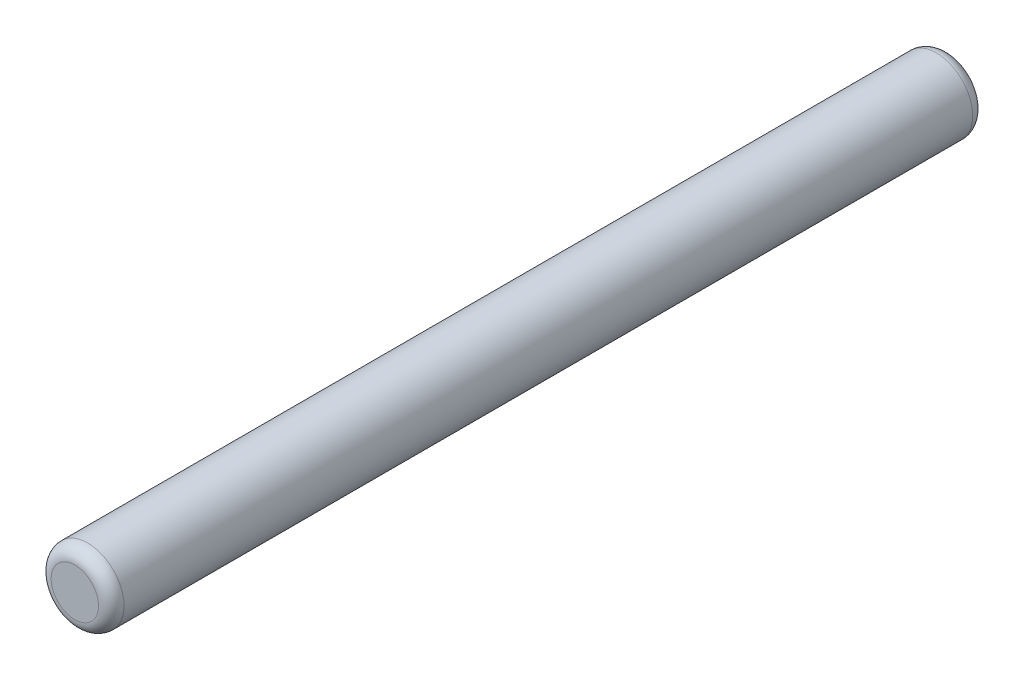
ISO-10303-21;
HEADER;
FILE_DESCRIPTION(('STEP AP214'),'2;1');
FILE_NAME('part.step','',(''),(''),'','','');
FILE_SCHEMA(('AUTOMOTIVE_DESIGN { 1 0 10303 214 1 1 1 1 }'));
ENDSEC;
DATA;
#1=APPLICATION_CONTEXT('core data for automotive mechanical design processes');
#2=APPLICATION_PROTOCOL_DEFINITION('international standard','automotive_design',2000,#1);
#3=PRODUCT_CONTEXT('',#1,'mechanical');
#4=PRODUCT('Part','Part','',(#3));
#5=PRODUCT_RELATED_PRODUCT_CATEGORY('part','',(#4));
#6=PRODUCT_DEFINITION_FORMATION('','',#4);
#7=PRODUCT_DEFINITION_CONTEXT('part definition',#1,'design');
#8=PRODUCT_DEFINITION('design','',#6,#7);
#9=PRODUCT_DEFINITION_SHAPE('','',#8);
#10=(LENGTH_UNIT() NAMED_UNIT(*) SI_UNIT(.MILLI.,.METRE.));
#11=(NAMED_UNIT(*) PLANE_ANGLE_UNIT() SI_UNIT($,.RADIAN.));
#12=(NAMED_UNIT(*) SI_UNIT($,.STERADIAN.) SOLID_ANGLE_UNIT());
#13=UNCERTAINTY_MEASURE_WITH_UNIT(LENGTH_MEASURE(1.E-05),#10,'distance_accuracy_value','');
#14=(GEOMETRIC_REPRESENTATION_CONTEXT(3) GLOBAL_UNCERTAINTY_ASSIGNED_CONTEXT((#13)) GLOBAL_UNIT_ASSIGNED_CONTEXT((#10,
#11,#12)) REPRESENTATION_CONTEXT('',''));
#15=CARTESIAN_POINT('',(0.,0.,0.));
#16=DIRECTION('',(0.,0.,1.));
#17=DIRECTION('',(1.,0.,0.));
#18=AXIS2_PLACEMENT_3D('',#15,#16,#17);
#19=CARTESIAN_POINT('',(0.,0.,12.));
#20=DIRECTION('',(0.,0.,-1.));
#21=DIRECTION('',(-1.,0.,0.));
#22=AXIS2_PLACEMENT_3D('',#19,#20,#21);
#23=CYLINDRICAL_SURFACE('',#22,1.);
#24=CARTESIAN_POINT('',(0.,0.,-11.65));
#25=DIRECTION('',(0.,0.,1.));
#26=DIRECTION('',(1.,0.,0.));
#27=AXIS2_PLACEMENT_3D('',#24,#25,#26);
#28=CIRCLE('',#27,1.);
#29=CARTESIAN_POINT('',(1.,0.,-11.65));
#30=VERTEX_POINT('',#29);
#31=EDGE_CURVE('E41',#30,#30,#28,.T.);
#32=ORIENTED_EDGE('',*,*,#31,.T.);
#33=EDGE_LOOP('',(#32));
#34=FACE_BOUND('',#33,.T.);
#35=CARTESIAN_POINT('',(0.,0.,11.65));
#36=DIRECTION('',(0.,0.,1.));
#37=DIRECTION('',(1.,0.,0.));
#38=AXIS2_PLACEMENT_3D('',#35,#36,#37);
#39=CIRCLE('',#38,1.);
#40=CARTESIAN_POINT('',(1.,0.,11.65));
#41=VERTEX_POINT('',#40);
#42=EDGE_CURVE('E45',#41,#41,#39,.F.);
#43=ORIENTED_EDGE('',*,*,#42,.T.);
#44=EDGE_LOOP('',(#43));
#45=FACE_BOUND('',#44,.T.);
#46=ADVANCED_FACE('F30',(#34,#45),#23,.T.);
#47=CARTESIAN_POINT('',(0.,0.,12.));
#48=DIRECTION('',(0.,0.,1.));
#49=DIRECTION('',(1.,0.,0.));
#50=AXIS2_PLACEMENT_3D('',#47,#48,#49);
#51=PLANE('',#50);
#52=CARTESIAN_POINT('',(0.,0.,12.));
#53=DIRECTION('',(0.,0.,1.));
#54=DIRECTION('',(1.,0.,0.));
#55=AXIS2_PLACEMENT_3D('',#52,#53,#54);
#56=CIRCLE('',#55,0.65);
#57=CARTESIAN_POINT('',(0.65,0.,12.));
#58=VERTEX_POINT('',#57);
#59=EDGE_CURVE('E10',#58,#58,#56,.T.);
#60=ORIENTED_EDGE('',*,*,#59,.T.);
#61=EDGE_LOOP('',(#60));
#62=FACE_BOUND('',#61,.T.);
#63=ADVANCED_FACE('F61',(#62),#51,.T.);
#64=CARTESIAN_POINT('',(0.,0.,-12.));
#65=DIRECTION('',(0.,0.,1.));
#66=DIRECTION('',(1.,0.,0.));
#67=AXIS2_PLACEMENT_3D('',#64,#65,#66);
#68=PLANE('',#67);
#69=CARTESIAN_POINT('',(0.,0.,-12.));
#70=DIRECTION('',(0.,0.,1.));
#71=DIRECTION('',(1.,0.,0.));
#72=AXIS2_PLACEMENT_3D('',#69,#70,#71);
#73=CIRCLE('',#72,0.65);
#74=CARTESIAN_POINT('',(0.65,0.,-12.));
#75=VERTEX_POINT('',#74);
#76=EDGE_CURVE('E37',#75,#75,#73,.F.);
#77=ORIENTED_EDGE('',*,*,#76,.T.);
#78=EDGE_LOOP('',(#77));
#79=FACE_BOUND('',#78,.T.);
#80=ADVANCED_FACE('F58',(#79),#68,.F.);
#81=CARTESIAN_POINT('',(0.,0.,-11.65));
#82=DIRECTION('',(0.,0.,1.));
#83=DIRECTION('',(1.,0.,0.));
#84=AXIS2_PLACEMENT_3D('',#81,#82,#83);
#85=TOROIDAL_SURFACE('',#84,0.65,0.35);
#86=ORIENTED_EDGE('',*,*,#76,.F.);
#87=EDGE_LOOP('',(#86));
#88=FACE_BOUND('',#87,.T.);
#89=ORIENTED_EDGE('',*,*,#31,.F.);
#90=EDGE_LOOP('',(#89));
#91=FACE_BOUND('',#90,.T.);
#92=ADVANCED_FACE('F54',(#88,#91),#85,.T.);
#93=CARTESIAN_POINT('',(0.,0.,11.65));
#94=DIRECTION('',(0.,0.,1.));
#95=DIRECTION('',(1.,0.,0.));
#96=AXIS2_PLACEMENT_3D('',#93,#94,#95);
#97=TOROIDAL_SURFACE('',#96,0.65,0.35);
#98=ORIENTED_EDGE('',*,*,#42,.F.);
#99=EDGE_LOOP('',(#98));
#100=FACE_BOUND('',#99,.T.);
#101=ORIENTED_EDGE('',*,*,#59,.F.);
#102=EDGE_LOOP('',(#101));
#103=FACE_BOUND('',#102,.T.);
#104=ADVANCED_FACE('F32',(#100,#103),#97,.T.);
#105=CLOSED_SHELL('',(#46,#63,#80,#92,#104));
#106=MANIFOLD_SOLID_BREP('B2',#105);
#107=ADVANCED_BREP_SHAPE_REPRESENTATION('',(#18,#106),#14);
#108=SHAPE_DEFINITION_REPRESENTATION(#9,#107);
ENDSEC;
END-ISO-10303-21;
